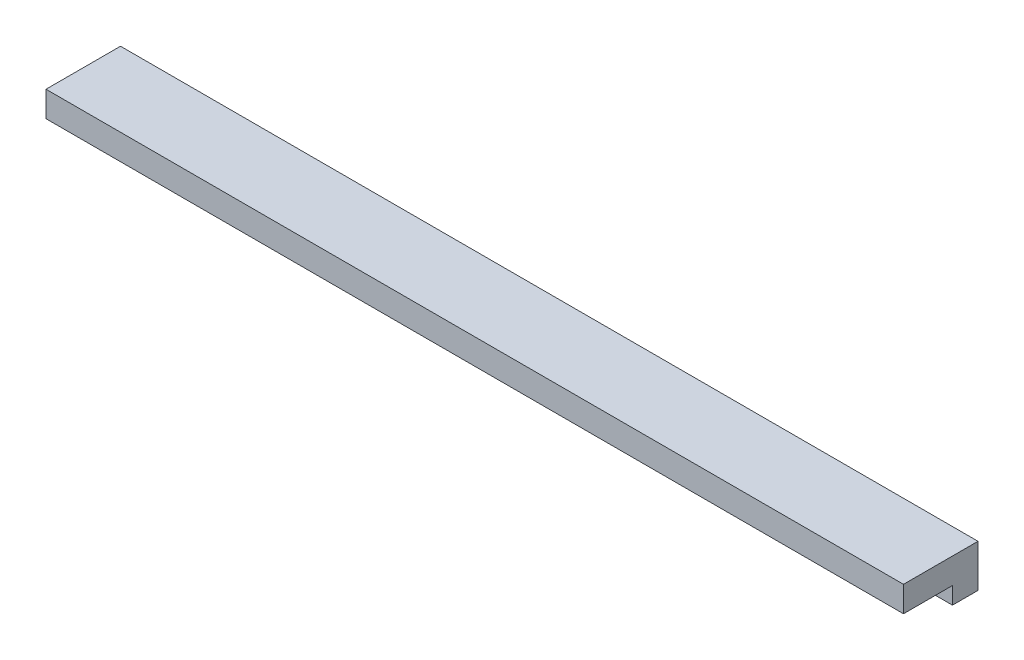
ISO-10303-21;
HEADER;
FILE_DESCRIPTION(('STEP AP214'),'2;1');
FILE_NAME('part.step','',(''),(''),'','','');
FILE_SCHEMA(('AUTOMOTIVE_DESIGN { 1 0 10303 214 1 1 1 1 }'));
ENDSEC;
DATA;
#1=APPLICATION_CONTEXT('core data for automotive mechanical design processes');
#2=APPLICATION_PROTOCOL_DEFINITION('international standard','automotive_design',2000,#1);
#3=PRODUCT_CONTEXT('',#1,'mechanical');
#4=PRODUCT('Part','Part','',(#3));
#5=PRODUCT_RELATED_PRODUCT_CATEGORY('part','',(#4));
#6=PRODUCT_DEFINITION_FORMATION('','',#4);
#7=PRODUCT_DEFINITION_CONTEXT('part definition',#1,'design');
#8=PRODUCT_DEFINITION('design','',#6,#7);
#9=PRODUCT_DEFINITION_SHAPE('','',#8);
#10=(LENGTH_UNIT() NAMED_UNIT(*) SI_UNIT(.MILLI.,.METRE.));
#11=(NAMED_UNIT(*) PLANE_ANGLE_UNIT() SI_UNIT($,.RADIAN.));
#12=(NAMED_UNIT(*) SI_UNIT($,.STERADIAN.) SOLID_ANGLE_UNIT());
#13=UNCERTAINTY_MEASURE_WITH_UNIT(LENGTH_MEASURE(1.E-05),#10,'distance_accuracy_value','');
#14=(GEOMETRIC_REPRESENTATION_CONTEXT(3) GLOBAL_UNCERTAINTY_ASSIGNED_CONTEXT((#13)) GLOBAL_UNIT_ASSIGNED_CONTEXT((#10,
#11,#12)) REPRESENTATION_CONTEXT('',''));
#15=CARTESIAN_POINT('',(0.,0.,0.));
#16=DIRECTION('',(0.,0.,1.));
#17=DIRECTION('',(1.,0.,0.));
#18=AXIS2_PLACEMENT_3D('',#15,#16,#17);
#19=CARTESIAN_POINT('',(-22.349229450169,-18.7034004147852,-1.58233054302401E-12));
#20=DIRECTION('',(1.,0.,0.));
#21=DIRECTION('',(0.,1.,0.));
#22=AXIS2_PLACEMENT_3D('',#19,#20,#21);
#23=PLANE('',#22);
#24=DIRECTION('',(0.,0.,1.));
#25=VECTOR('',#24,1.);
#26=CARTESIAN_POINT('',(-22.349229450169,-8.7034004147857,3.));
#27=LINE('',#26,#25);
#28=CARTESIAN_POINT('',(-22.349229450169,-8.70340041478571,0.));
#29=VERTEX_POINT('',#28);
#30=CARTESIAN_POINT('',(-22.349229450169,-8.70340041478571,3.));
#31=VERTEX_POINT('',#30);
#32=EDGE_CURVE('E40',#29,#31,#27,.T.);
#33=ORIENTED_EDGE('',*,*,#32,.F.);
#34=DIRECTION('',(0.,-1.,0.));
#35=VECTOR('',#34,1.);
#36=CARTESIAN_POINT('',(-22.349229450169,-3.70340041478569,0.));
#37=LINE('',#36,#35);
#38=CARTESIAN_POINT('',(-22.349229450169,-3.70340041478569,0.));
#39=VERTEX_POINT('',#38);
#40=EDGE_CURVE('E114',#39,#29,#37,.T.);
#41=ORIENTED_EDGE('',*,*,#40,.F.);
#42=DIRECTION('',(0.,0.,-1.));
#43=VECTOR('',#42,1.);
#44=CARTESIAN_POINT('',(-22.349229450169,-3.70340041478569,8.74999999999998));
#45=LINE('',#44,#43);
#46=CARTESIAN_POINT('',(-22.349229450169,-3.70340041478569,8.74999999999999));
#47=VERTEX_POINT('',#46);
#48=EDGE_CURVE('E118',#47,#39,#45,.T.);
#49=ORIENTED_EDGE('',*,*,#48,.F.);
#50=DIRECTION('',(0.,1.,0.));
#51=VECTOR('',#50,1.);
#52=CARTESIAN_POINT('',(-22.349229450169,-6.70340041478569,8.74999999999999));
#53=LINE('',#52,#51);
#54=CARTESIAN_POINT('',(-22.349229450169,-6.70340041478569,8.74999999999999));
#55=VERTEX_POINT('',#54);
#56=EDGE_CURVE('E69',#55,#47,#53,.T.);
#57=ORIENTED_EDGE('',*,*,#56,.F.);
#58=DIRECTION('',(0.,0.,1.));
#59=VECTOR('',#58,1.);
#60=CARTESIAN_POINT('',(-22.349229450169,-6.70340041478569,8.74999999999999));
#61=LINE('',#60,#59);
#62=CARTESIAN_POINT('',(-22.349229450169,-6.70340041478569,3.));
#63=VERTEX_POINT('',#62);
#64=EDGE_CURVE('E74',#63,#55,#61,.T.);
#65=ORIENTED_EDGE('',*,*,#64,.F.);
#66=DIRECTION('',(0.,1.,0.));
#67=VECTOR('',#66,1.);
#68=CARTESIAN_POINT('',(-22.349229450169,-6.70340041478569,3.));
#69=LINE('',#68,#67);
#70=EDGE_CURVE('E95',#31,#63,#69,.T.);
#71=ORIENTED_EDGE('',*,*,#70,.F.);
#72=EDGE_LOOP('',(#33,#41,#49,#57,#65,#71));
#73=FACE_BOUND('',#72,.T.);
#74=ADVANCED_FACE('F32',(#73),#23,.T.);
#75=CARTESIAN_POINT('',(-123.049709026504,0.,0.));
#76=DIRECTION('',(-1.,0.,0.));
#77=DIRECTION('',(0.,0.,1.));
#78=AXIS2_PLACEMENT_3D('',#75,#76,#77);
#79=PLANE('',#78);
#80=DIRECTION('',(0.,0.,1.));
#81=VECTOR('',#80,1.);
#82=CARTESIAN_POINT('',(-123.049709026504,-8.70340041478571,3.));
#83=LINE('',#82,#81);
#84=CARTESIAN_POINT('',(-123.049709026504,-8.70340041478571,0.));
#85=VERTEX_POINT('',#84);
#86=CARTESIAN_POINT('',(-123.049709026504,-8.70340041478571,3.));
#87=VERTEX_POINT('',#86);
#88=EDGE_CURVE('E105',#85,#87,#83,.T.);
#89=ORIENTED_EDGE('',*,*,#88,.T.);
#90=DIRECTION('',(0.,1.,0.));
#91=VECTOR('',#90,1.);
#92=CARTESIAN_POINT('',(-123.049709026504,-6.70340041478571,3.));
#93=LINE('',#92,#91);
#94=CARTESIAN_POINT('',(-123.049709026504,-6.70340041478571,3.));
#95=VERTEX_POINT('',#94);
#96=EDGE_CURVE('E93',#87,#95,#93,.T.);
#97=ORIENTED_EDGE('',*,*,#96,.T.);
#98=DIRECTION('',(0.,0.,1.));
#99=VECTOR('',#98,1.);
#100=CARTESIAN_POINT('',(-123.049709026504,-6.70340041478571,8.74999999999999));
#101=LINE('',#100,#99);
#102=CARTESIAN_POINT('',(-123.049709026504,-6.70340041478571,8.74999999999999));
#103=VERTEX_POINT('',#102);
#104=EDGE_CURVE('E97',#95,#103,#101,.T.);
#105=ORIENTED_EDGE('',*,*,#104,.T.);
#106=DIRECTION('',(0.,1.,0.));
#107=VECTOR('',#106,1.);
#108=CARTESIAN_POINT('',(-123.049709026504,-6.70340041478571,8.74999999999999));
#109=LINE('',#108,#107);
#110=CARTESIAN_POINT('',(-123.049709026504,-3.70340041478571,8.74999999999999));
#111=VERTEX_POINT('',#110);
#112=EDGE_CURVE('E101',#103,#111,#109,.T.);
#113=ORIENTED_EDGE('',*,*,#112,.T.);
#114=DIRECTION('',(0.,0.,-1.));
#115=VECTOR('',#114,1.);
#116=CARTESIAN_POINT('',(-123.049709026504,-3.70340041478571,8.74999999999999));
#117=LINE('',#116,#115);
#118=CARTESIAN_POINT('',(-123.049709026504,-3.7034004147857,0.));
#119=VERTEX_POINT('',#118);
#120=EDGE_CURVE('E133',#111,#119,#117,.T.);
#121=ORIENTED_EDGE('',*,*,#120,.T.);
#122=DIRECTION('',(0.,-1.,0.));
#123=VECTOR('',#122,1.);
#124=CARTESIAN_POINT('',(-123.049709026504,-3.7034004147857,0.));
#125=LINE('',#124,#123);
#126=EDGE_CURVE('E111',#119,#85,#125,.T.);
#127=ORIENTED_EDGE('',*,*,#126,.T.);
#128=EDGE_LOOP('',(#89,#97,#105,#113,#121,#127));
#129=FACE_BOUND('',#128,.T.);
#130=ADVANCED_FACE('F103',(#129),#79,.T.);
#131=CARTESIAN_POINT('',(-2.27140726479577,-6.70340041478569,3.));
#132=DIRECTION('',(0.,0.,1.));
#133=DIRECTION('',(1.,0.,0.));
#134=AXIS2_PLACEMENT_3D('',#131,#132,#133);
#135=PLANE('',#134);
#136=DIRECTION('',(-1.,0.,0.));
#137=VECTOR('',#136,1.);
#138=CARTESIAN_POINT('',(-2.27140726479577,-8.70340041478569,3.));
#139=LINE('',#138,#137);
#140=EDGE_CURVE('E11',#31,#87,#139,.T.);
#141=ORIENTED_EDGE('',*,*,#140,.F.);
#142=ORIENTED_EDGE('',*,*,#70,.T.);
#143=DIRECTION('',(-1.,0.,0.));
#144=VECTOR('',#143,1.);
#145=CARTESIAN_POINT('',(-2.27140726479577,-6.70340041478569,3.));
#146=LINE('',#145,#144);
#147=EDGE_CURVE('E90',#63,#95,#146,.T.);
#148=ORIENTED_EDGE('',*,*,#147,.T.);
#149=ORIENTED_EDGE('',*,*,#96,.F.);
#150=EDGE_LOOP('',(#141,#142,#148,#149));
#151=FACE_BOUND('',#150,.T.);
#152=ADVANCED_FACE('F91',(#151),#135,.T.);
#153=CARTESIAN_POINT('',(-2.27140726479577,-6.70340041478569,8.74999999999999));
#154=DIRECTION('',(0.,-1.,0.));
#155=DIRECTION('',(1.,0.,0.));
#156=AXIS2_PLACEMENT_3D('',#153,#154,#155);
#157=PLANE('',#156);
#158=ORIENTED_EDGE('',*,*,#147,.F.);
#159=ORIENTED_EDGE('',*,*,#64,.T.);
#160=DIRECTION('',(-1.,0.,0.));
#161=VECTOR('',#160,1.);
#162=CARTESIAN_POINT('',(-2.27140726479577,-6.70340041478569,8.74999999999999));
#163=LINE('',#162,#161);
#164=EDGE_CURVE('E85',#55,#103,#163,.T.);
#165=ORIENTED_EDGE('',*,*,#164,.T.);
#166=ORIENTED_EDGE('',*,*,#104,.F.);
#167=EDGE_LOOP('',(#158,#159,#165,#166));
#168=FACE_BOUND('',#167,.T.);
#169=ADVANCED_FACE('F98',(#168),#157,.T.);
#170=CARTESIAN_POINT('',(-2.27140726479577,-6.70340041478569,8.74999999999999));
#171=DIRECTION('',(0.,0.,1.));
#172=DIRECTION('',(0.,-1.,0.));
#173=AXIS2_PLACEMENT_3D('',#170,#171,#172);
#174=PLANE('',#173);
#175=ORIENTED_EDGE('',*,*,#164,.F.);
#176=ORIENTED_EDGE('',*,*,#56,.T.);
#177=DIRECTION('',(-1.,0.,0.));
#178=VECTOR('',#177,1.);
#179=CARTESIAN_POINT('',(-2.27140726479577,-3.70340041478569,8.74999999999999));
#180=LINE('',#179,#178);
#181=EDGE_CURVE('E121',#47,#111,#180,.T.);
#182=ORIENTED_EDGE('',*,*,#181,.T.);
#183=ORIENTED_EDGE('',*,*,#112,.F.);
#184=EDGE_LOOP('',(#175,#176,#182,#183));
#185=FACE_BOUND('',#184,.T.);
#186=ADVANCED_FACE('F130',(#185),#174,.T.);
#187=CARTESIAN_POINT('',(-2.27140726479577,-3.70340041478569,8.74999999999999));
#188=DIRECTION('',(0.,1.,0.));
#189=DIRECTION('',(0.,0.,1.));
#190=AXIS2_PLACEMENT_3D('',#187,#188,#189);
#191=PLANE('',#190);
#192=ORIENTED_EDGE('',*,*,#181,.F.);
#193=ORIENTED_EDGE('',*,*,#48,.T.);
#194=DIRECTION('',(-1.,0.,0.));
#195=VECTOR('',#194,1.);
#196=CARTESIAN_POINT('',(-2.27140726479577,-3.70340041478569,0.));
#197=LINE('',#196,#195);
#198=EDGE_CURVE('E117',#39,#119,#197,.T.);
#199=ORIENTED_EDGE('',*,*,#198,.T.);
#200=ORIENTED_EDGE('',*,*,#120,.F.);
#201=EDGE_LOOP('',(#192,#193,#199,#200));
#202=FACE_BOUND('',#201,.T.);
#203=ADVANCED_FACE('F134',(#202),#191,.T.);
#204=CARTESIAN_POINT('',(-2.27140726479577,-3.70340041478569,0.));
#205=DIRECTION('',(0.,0.,-1.));
#206=DIRECTION('',(0.,1.,0.));
#207=AXIS2_PLACEMENT_3D('',#204,#205,#206);
#208=PLANE('',#207);
#209=ORIENTED_EDGE('',*,*,#198,.F.);
#210=ORIENTED_EDGE('',*,*,#40,.T.);
#211=DIRECTION('',(-1.,0.,0.));
#212=VECTOR('',#211,1.);
#213=CARTESIAN_POINT('',(-2.27140726479577,-8.70340041478569,0.));
#214=LINE('',#213,#212);
#215=EDGE_CURVE('E113',#29,#85,#214,.T.);
#216=ORIENTED_EDGE('',*,*,#215,.T.);
#217=ORIENTED_EDGE('',*,*,#126,.F.);
#218=EDGE_LOOP('',(#209,#210,#216,#217));
#219=FACE_BOUND('',#218,.T.);
#220=ADVANCED_FACE('F140',(#219),#208,.T.);
#221=CARTESIAN_POINT('',(-2.27140726479577,-8.70340041478569,3.));
#222=DIRECTION('',(0.,-1.,0.));
#223=DIRECTION('',(1.,0.,0.));
#224=AXIS2_PLACEMENT_3D('',#221,#222,#223);
#225=PLANE('',#224);
#226=ORIENTED_EDGE('',*,*,#215,.F.);
#227=ORIENTED_EDGE('',*,*,#32,.T.);
#228=ORIENTED_EDGE('',*,*,#140,.T.);
#229=ORIENTED_EDGE('',*,*,#88,.F.);
#230=EDGE_LOOP('',(#226,#227,#228,#229));
#231=FACE_BOUND('',#230,.T.);
#232=ADVANCED_FACE('F142',(#231),#225,.T.);
#233=CLOSED_SHELL('',(#74,#130,#152,#169,#186,#203,#220,#232));
#234=MANIFOLD_SOLID_BREP('B2',#233);
#235=ADVANCED_BREP_SHAPE_REPRESENTATION('',(#18,#234),#14);
#236=SHAPE_DEFINITION_REPRESENTATION(#9,#235);
ENDSEC;
END-ISO-10303-21;
